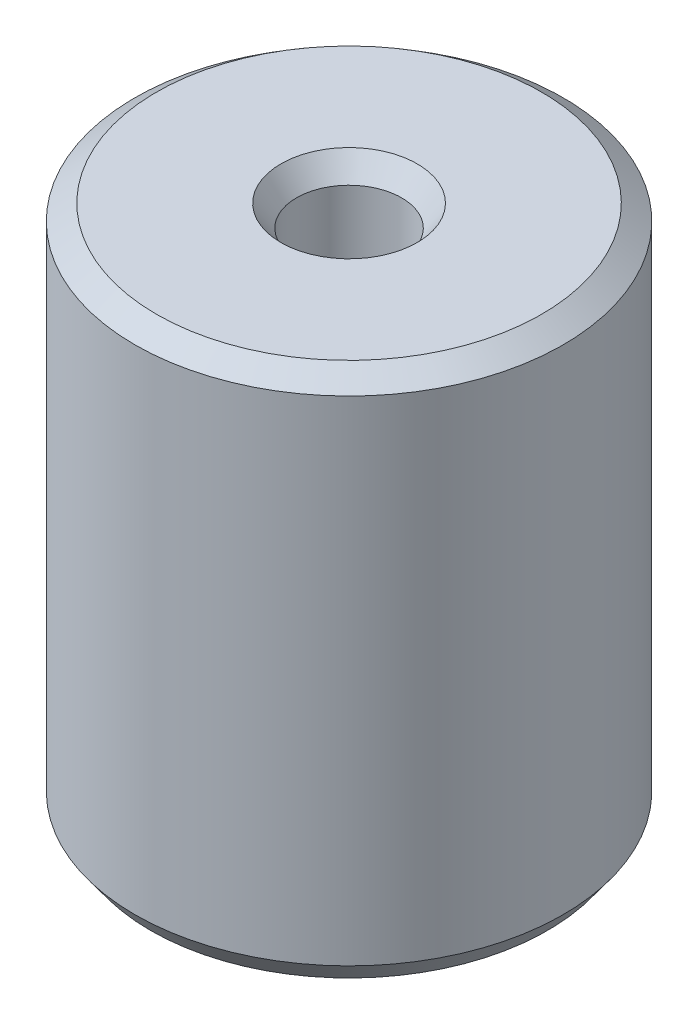
ISO-10303-21;
HEADER;
FILE_DESCRIPTION(('STEP AP214'),'2;1');
FILE_NAME('part.step','',(''),(''),'','','');
FILE_SCHEMA(('AUTOMOTIVE_DESIGN { 1 0 10303 214 1 1 1 1 }'));
ENDSEC;
DATA;
#1=APPLICATION_CONTEXT('core data for automotive mechanical design processes');
#2=APPLICATION_PROTOCOL_DEFINITION('international standard','automotive_design',2000,#1);
#3=PRODUCT_CONTEXT('',#1,'mechanical');
#4=PRODUCT('Part','Part','',(#3));
#5=PRODUCT_RELATED_PRODUCT_CATEGORY('part','',(#4));
#6=PRODUCT_DEFINITION_FORMATION('','',#4);
#7=PRODUCT_DEFINITION_CONTEXT('part definition',#1,'design');
#8=PRODUCT_DEFINITION('design','',#6,#7);
#9=PRODUCT_DEFINITION_SHAPE('','',#8);
#10=(LENGTH_UNIT() NAMED_UNIT(*) SI_UNIT(.MILLI.,.METRE.));
#11=(NAMED_UNIT(*) PLANE_ANGLE_UNIT() SI_UNIT($,.RADIAN.));
#12=(NAMED_UNIT(*) SI_UNIT($,.STERADIAN.) SOLID_ANGLE_UNIT());
#13=UNCERTAINTY_MEASURE_WITH_UNIT(LENGTH_MEASURE(1.E-05),#10,'distance_accuracy_value','');
#14=(GEOMETRIC_REPRESENTATION_CONTEXT(3) GLOBAL_UNCERTAINTY_ASSIGNED_CONTEXT((#13)) GLOBAL_UNIT_ASSIGNED_CONTEXT((#10,
#11,#12)) REPRESENTATION_CONTEXT('',''));
#15=CARTESIAN_POINT('',(0.,0.,0.));
#16=DIRECTION('',(0.,0.,1.));
#17=DIRECTION('',(1.,0.,0.));
#18=AXIS2_PLACEMENT_3D('',#15,#16,#17);
#19=CARTESIAN_POINT('',(0.,12.394601799748,0.));
#20=DIRECTION('',(0.,-1.,0.));
#21=DIRECTION('',(0.,0.,-1.));
#22=AXIS2_PLACEMENT_3D('',#19,#20,#21);
#23=CYLINDRICAL_SURFACE('',#22,5.);
#24=CARTESIAN_POINT('',(0.,0.50374646718644,0.));
#25=DIRECTION('',(0.,1.,0.));
#26=DIRECTION('',(0.,0.,1.));
#27=AXIS2_PLACEMENT_3D('',#24,#25,#26);
#28=CIRCLE('',#27,5.);
#29=CARTESIAN_POINT('',(0.,0.50374646718644,5.));
#30=VERTEX_POINT('',#29);
#31=EDGE_CURVE('E10',#30,#30,#28,.T.);
#32=ORIENTED_EDGE('',*,*,#31,.T.);
#33=EDGE_LOOP('',(#32));
#34=FACE_BOUND('',#33,.T.);
#35=CARTESIAN_POINT('',(0.,12.0289318805808,0.));
#36=DIRECTION('',(0.,1.,0.));
#37=DIRECTION('',(0.,0.,1.));
#38=AXIS2_PLACEMENT_3D('',#35,#36,#37);
#39=CIRCLE('',#38,5.);
#40=CARTESIAN_POINT('',(0.,12.0289318805808,5.));
#41=VERTEX_POINT('',#40);
#42=EDGE_CURVE('E50',#41,#41,#39,.F.);
#43=ORIENTED_EDGE('',*,*,#42,.T.);
#44=EDGE_LOOP('',(#43));
#45=FACE_BOUND('',#44,.T.);
#46=ADVANCED_FACE('F39',(#34,#45),#23,.T.);
#47=CARTESIAN_POINT('',(0.,12.394601799748,0.));
#48=DIRECTION('',(0.,1.,0.));
#49=DIRECTION('',(0.,0.,1.));
#50=AXIS2_PLACEMENT_3D('',#47,#48,#49);
#51=PLANE('',#50);
#52=CARTESIAN_POINT('',(0.,12.394601799748,0.));
#53=DIRECTION('',(0.,1.,0.));
#54=DIRECTION('',(0.,0.,1.));
#55=AXIS2_PLACEMENT_3D('',#52,#53,#54);
#56=CIRCLE('',#55,1.59243291281076);
#57=CARTESIAN_POINT('',(0.,12.394601799748,1.59243291281076));
#58=VERTEX_POINT('',#57);
#59=EDGE_CURVE('E58',#58,#58,#56,.F.);
#60=ORIENTED_EDGE('',*,*,#59,.T.);
#61=EDGE_LOOP('',(#60));
#62=FACE_BOUND('',#61,.T.);
#63=CARTESIAN_POINT('',(0.,12.394601799748,0.));
#64=DIRECTION('',(0.,1.,0.));
#65=DIRECTION('',(0.,0.,1.));
#66=AXIS2_PLACEMENT_3D('',#63,#64,#65);
#67=CIRCLE('',#66,4.49625353281356);
#68=CARTESIAN_POINT('',(0.,12.394601799748,4.49625353281356));
#69=VERTEX_POINT('',#68);
#70=EDGE_CURVE('E61',#69,#69,#67,.T.);
#71=ORIENTED_EDGE('',*,*,#70,.T.);
#72=EDGE_LOOP('',(#71));
#73=FACE_BOUND('',#72,.T.);
#74=ADVANCED_FACE('F88',(#62,#73),#51,.T.);
#75=CARTESIAN_POINT('',(0.,0.,0.));
#76=DIRECTION('',(0.,1.,0.));
#77=DIRECTION('',(0.,0.,1.));
#78=AXIS2_PLACEMENT_3D('',#75,#76,#77);
#79=PLANE('',#78);
#80=CARTESIAN_POINT('',(0.,0.,0.));
#81=DIRECTION('',(0.,1.,0.));
#82=DIRECTION('',(0.,0.,1.));
#83=AXIS2_PLACEMENT_3D('',#80,#81,#82);
#84=CIRCLE('',#83,1.73050946082995);
#85=CARTESIAN_POINT('',(0.,0.,1.73050946082995));
#86=VERTEX_POINT('',#85);
#87=EDGE_CURVE('E51',#86,#86,#84,.T.);
#88=ORIENTED_EDGE('',*,*,#87,.T.);
#89=EDGE_LOOP('',(#88));
#90=FACE_BOUND('',#89,.T.);
#91=CARTESIAN_POINT('',(0.,0.,0.));
#92=DIRECTION('',(0.,1.,0.));
#93=DIRECTION('',(0.,0.,1.));
#94=AXIS2_PLACEMENT_3D('',#91,#92,#93);
#95=CIRCLE('',#94,4.63433008083275);
#96=CARTESIAN_POINT('',(0.,0.,4.63433008083275));
#97=VERTEX_POINT('',#96);
#98=EDGE_CURVE('E54',#97,#97,#95,.F.);
#99=ORIENTED_EDGE('',*,*,#98,.T.);
#100=EDGE_LOOP('',(#99));
#101=FACE_BOUND('',#100,.T.);
#102=ADVANCED_FACE('F83',(#90,#101),#79,.F.);
#103=CARTESIAN_POINT('',(0.,12.394601799748,0.));
#104=DIRECTION('',(0.,-1.,0.));
#105=DIRECTION('',(0.,0.,-1.));
#106=AXIS2_PLACEMENT_3D('',#103,#104,#105);
#107=CYLINDRICAL_SURFACE('',#106,1.22676299364351);
#108=CARTESIAN_POINT('',(0.,11.8908553325616,0.));
#109=DIRECTION('',(0.,1.,0.));
#110=DIRECTION('',(0.,0.,1.));
#111=AXIS2_PLACEMENT_3D('',#108,#109,#110);
#112=CIRCLE('',#111,1.22676299364351);
#113=CARTESIAN_POINT('',(0.,11.8908553325616,1.22676299364351));
#114=VERTEX_POINT('',#113);
#115=EDGE_CURVE('E67',#114,#114,#112,.T.);
#116=ORIENTED_EDGE('',*,*,#115,.T.);
#117=EDGE_LOOP('',(#116));
#118=FACE_BOUND('',#117,.T.);
#119=CARTESIAN_POINT('',(0.,0.365669919167245,0.));
#120=DIRECTION('',(0.,1.,0.));
#121=DIRECTION('',(0.,0.,1.));
#122=AXIS2_PLACEMENT_3D('',#119,#120,#121);
#123=CIRCLE('',#122,1.22676299364351);
#124=CARTESIAN_POINT('',(0.,0.365669919167245,1.22676299364351));
#125=VERTEX_POINT('',#124);
#126=EDGE_CURVE('E69',#125,#125,#123,.F.);
#127=ORIENTED_EDGE('',*,*,#126,.T.);
#128=EDGE_LOOP('',(#127));
#129=FACE_BOUND('',#128,.T.);
#130=ADVANCED_FACE('F71',(#118,#129),#107,.F.);
#131=CARTESIAN_POINT('',(0.,11.8908553325616,0.));
#132=DIRECTION('',(0.,1.,0.));
#133=DIRECTION('',(0.,0.,1.));
#134=AXIS2_PLACEMENT_3D('',#131,#132,#133);
#135=CONICAL_SURFACE('',#134,1.22676299364351,0.627898328426987);
#136=ORIENTED_EDGE('',*,*,#59,.F.);
#137=EDGE_LOOP('',(#136));
#138=FACE_BOUND('',#137,.T.);
#139=ORIENTED_EDGE('',*,*,#115,.F.);
#140=EDGE_LOOP('',(#139));
#141=FACE_BOUND('',#140,.T.);
#142=ADVANCED_FACE('F77',(#138,#141),#135,.F.);
#143=CARTESIAN_POINT('',(0.,0.,0.));
#144=DIRECTION('',(0.,-1.,0.));
#145=DIRECTION('',(0.,0.,-1.));
#146=AXIS2_PLACEMENT_3D('',#143,#144,#145);
#147=CONICAL_SURFACE('',#146,1.73050946082995,0.942897998367909);
#148=ORIENTED_EDGE('',*,*,#126,.F.);
#149=EDGE_LOOP('',(#148));
#150=FACE_BOUND('',#149,.T.);
#151=ORIENTED_EDGE('',*,*,#87,.F.);
#152=EDGE_LOOP('',(#151));
#153=FACE_BOUND('',#152,.T.);
#154=ADVANCED_FACE('F73',(#150,#153),#147,.F.);
#155=CARTESIAN_POINT('',(0.,0.50374646718644,0.));
#156=DIRECTION('',(0.,1.,0.));
#157=DIRECTION('',(0.,0.,1.));
#158=AXIS2_PLACEMENT_3D('',#155,#156,#157);
#159=CONICAL_SURFACE('',#158,5.,0.627898328426988);
#160=ORIENTED_EDGE('',*,*,#98,.F.);
#161=EDGE_LOOP('',(#160));
#162=FACE_BOUND('',#161,.T.);
#163=ORIENTED_EDGE('',*,*,#31,.F.);
#164=EDGE_LOOP('',(#163));
#165=FACE_BOUND('',#164,.T.);
#166=ADVANCED_FACE('F76',(#162,#165),#159,.T.);
#167=CARTESIAN_POINT('',(0.,12.394601799748,0.));
#168=DIRECTION('',(0.,-1.,0.));
#169=DIRECTION('',(0.,0.,-1.));
#170=AXIS2_PLACEMENT_3D('',#167,#168,#169);
#171=CONICAL_SURFACE('',#170,4.49625353281356,0.94289799836791);
#172=ORIENTED_EDGE('',*,*,#42,.F.);
#173=EDGE_LOOP('',(#172));
#174=FACE_BOUND('',#173,.T.);
#175=ORIENTED_EDGE('',*,*,#70,.F.);
#176=EDGE_LOOP('',(#175));
#177=FACE_BOUND('',#176,.T.);
#178=ADVANCED_FACE('F45',(#174,#177),#171,.T.);
#179=CLOSED_SHELL('',(#46,#74,#102,#130,#142,#154,#166,#178));
#180=MANIFOLD_SOLID_BREP('B2',#179);
#181=ADVANCED_BREP_SHAPE_REPRESENTATION('',(#18,#180),#14);
#182=SHAPE_DEFINITION_REPRESENTATION(#9,#181);
ENDSEC;
END-ISO-10303-21;
